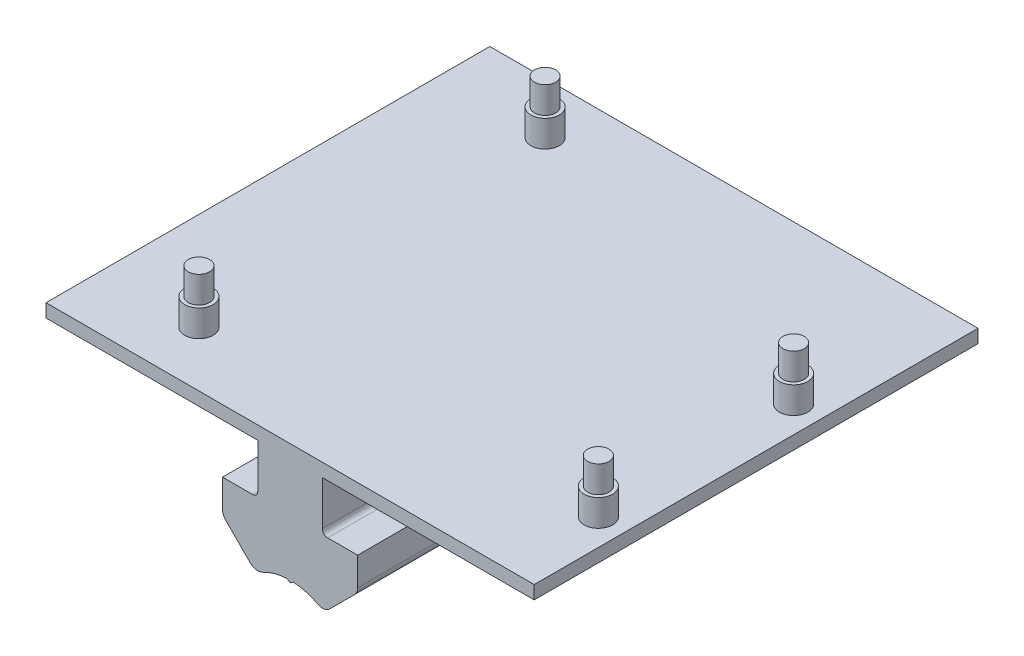
ISO-10303-21;
HEADER;
FILE_DESCRIPTION(('STEP AP214'),'2;1');
FILE_NAME('part.step','',(''),(''),'','','');
FILE_SCHEMA(('AUTOMOTIVE_DESIGN { 1 0 10303 214 1 1 1 1 }'));
ENDSEC;
DATA;
#1=APPLICATION_CONTEXT('core data for automotive mechanical design processes');
#2=APPLICATION_PROTOCOL_DEFINITION('international standard','automotive_design',2000,#1);
#3=PRODUCT_CONTEXT('',#1,'mechanical');
#4=PRODUCT('Part','Part','',(#3));
#5=PRODUCT_RELATED_PRODUCT_CATEGORY('part','',(#4));
#6=PRODUCT_DEFINITION_FORMATION('','',#4);
#7=PRODUCT_DEFINITION_CONTEXT('part definition',#1,'design');
#8=PRODUCT_DEFINITION('design','',#6,#7);
#9=PRODUCT_DEFINITION_SHAPE('','',#8);
#10=(LENGTH_UNIT() NAMED_UNIT(*) SI_UNIT(.MILLI.,.METRE.));
#11=(NAMED_UNIT(*) PLANE_ANGLE_UNIT() SI_UNIT($,.RADIAN.));
#12=(NAMED_UNIT(*) SI_UNIT($,.STERADIAN.) SOLID_ANGLE_UNIT());
#13=UNCERTAINTY_MEASURE_WITH_UNIT(LENGTH_MEASURE(1.E-05),#10,'distance_accuracy_value','');
#14=(GEOMETRIC_REPRESENTATION_CONTEXT(3) GLOBAL_UNCERTAINTY_ASSIGNED_CONTEXT((#13)) GLOBAL_UNIT_ASSIGNED_CONTEXT((#10,
#11,#12)) REPRESENTATION_CONTEXT('',''));
#15=CARTESIAN_POINT('',(0.,0.,0.));
#16=DIRECTION('',(0.,0.,1.));
#17=DIRECTION('',(1.,0.,0.));
#18=AXIS2_PLACEMENT_3D('',#15,#16,#17);
#19=CARTESIAN_POINT('',(-15.7881502716479,70.5217865494155,370.226101294247));
#20=DIRECTION('',(-1.,0.,0.));
#21=DIRECTION('',(0.,0.,1.));
#22=AXIS2_PLACEMENT_3D('',#19,#20,#21);
#23=PLANE('',#22);
#24=DIRECTION('',(0.,-1.,0.));
#25=VECTOR('',#24,1.);
#26=CARTESIAN_POINT('',(-15.7881502716479,70.5217865494155,433.726101294247));
#27=LINE('',#26,#25);
#28=CARTESIAN_POINT('',(-15.7881502716479,72.4267865494155,433.726101294247));
#29=VERTEX_POINT('',#28);
#30=CARTESIAN_POINT('',(-15.7881502716479,70.5217865494155,433.726101294247));
#31=VERTEX_POINT('',#30);
#32=EDGE_CURVE('E225',#29,#31,#27,.T.);
#33=ORIENTED_EDGE('',*,*,#32,.F.);
#34=DIRECTION('',(0.,0.,1.));
#35=VECTOR('',#34,1.);
#36=CARTESIAN_POINT('',(-15.7881502716479,72.4267865494155,370.226101294247));
#37=LINE('',#36,#35);
#38=CARTESIAN_POINT('',(-15.7881502716479,72.4267865494155,370.226101294247));
#39=VERTEX_POINT('',#38);
#40=EDGE_CURVE('E11',#39,#29,#37,.T.);
#41=ORIENTED_EDGE('',*,*,#40,.F.);
#42=DIRECTION('',(0.,-1.,0.));
#43=VECTOR('',#42,1.);
#44=CARTESIAN_POINT('',(-15.7881502716479,70.5217865494155,370.226101294247));
#45=LINE('',#44,#43);
#46=CARTESIAN_POINT('',(-15.7881502716479,70.5217865494155,370.226101294247));
#47=VERTEX_POINT('',#46);
#48=EDGE_CURVE('E291',#39,#47,#45,.T.);
#49=ORIENTED_EDGE('',*,*,#48,.T.);
#50=DIRECTION('',(0.,0.,1.));
#51=VECTOR('',#50,1.);
#52=CARTESIAN_POINT('',(-15.7881502716479,70.5217865494155,370.226101294247));
#53=LINE('',#52,#51);
#54=EDGE_CURVE('E138',#47,#31,#53,.T.);
#55=ORIENTED_EDGE('',*,*,#54,.T.);
#56=EDGE_LOOP('',(#33,#41,#49,#55));
#57=FACE_BOUND('',#56,.T.);
#58=ADVANCED_FACE('F37',(#57),#23,.T.);
#59=CARTESIAN_POINT('',(-15.7881502716479,72.4267865494155,370.226101294247));
#60=DIRECTION('',(0.,1.,0.));
#61=DIRECTION('',(0.,0.,1.));
#62=AXIS2_PLACEMENT_3D('',#59,#60,#61);
#63=PLANE('',#62);
#64=CARTESIAN_POINT('',(-1.81815027164785,72.4267865494155,425.814863045515));
#65=DIRECTION('',(0.,1.,0.));
#66=DIRECTION('',(0.,0.,1.));
#67=AXIS2_PLACEMENT_3D('',#64,#65,#66);
#68=CIRCLE('',#67,2.03200000000004);
#69=CARTESIAN_POINT('',(-1.81815027164785,72.4267865494155,427.846863045515));
#70=VERTEX_POINT('',#69);
#71=EDGE_CURVE('E628',#70,#70,#68,.T.);
#72=ORIENTED_EDGE('',*,*,#71,.F.);
#73=EDGE_LOOP('',(#72));
#74=FACE_BOUND('',#73,.T.);
#75=CARTESIAN_POINT('',(50.2518497283521,72.4267865494155,420.734863045515));
#76=DIRECTION('',(0.,1.,0.));
#77=DIRECTION('',(0.,0.,1.));
#78=AXIS2_PLACEMENT_3D('',#75,#76,#77);
#79=CIRCLE('',#78,2.03199999999995);
#80=CARTESIAN_POINT('',(50.2518497283521,72.4267865494155,422.766863045515));
#81=VERTEX_POINT('',#80);
#82=EDGE_CURVE('E347',#81,#81,#79,.T.);
#83=ORIENTED_EDGE('',*,*,#82,.F.);
#84=EDGE_LOOP('',(#83));
#85=FACE_BOUND('',#84,.T.);
#86=CARTESIAN_POINT('',(50.2518497283521,72.4267865494155,392.794863045515));
#87=DIRECTION('',(0.,1.,0.));
#88=DIRECTION('',(0.,0.,1.));
#89=AXIS2_PLACEMENT_3D('',#86,#87,#88);
#90=CIRCLE('',#89,2.03199999999995);
#91=CARTESIAN_POINT('',(50.2518497283521,72.4267865494155,394.826863045515));
#92=VERTEX_POINT('',#91);
#93=EDGE_CURVE('E343',#92,#92,#90,.T.);
#94=ORIENTED_EDGE('',*,*,#93,.F.);
#95=EDGE_LOOP('',(#94));
#96=FACE_BOUND('',#95,.T.);
#97=CARTESIAN_POINT('',(-0.548150271647851,72.4267865494155,377.554863045515));
#98=DIRECTION('',(0.,1.,0.));
#99=DIRECTION('',(0.,0.,1.));
#100=AXIS2_PLACEMENT_3D('',#97,#98,#99);
#101=CIRCLE('',#100,2.03200000000004);
#102=CARTESIAN_POINT('',(-0.548150271647851,72.4267865494155,379.586863045515));
#103=VERTEX_POINT('',#102);
#104=EDGE_CURVE('E342',#103,#103,#101,.T.);
#105=ORIENTED_EDGE('',*,*,#104,.F.);
#106=EDGE_LOOP('',(#105));
#107=FACE_BOUND('',#106,.T.);
#108=DIRECTION('',(-1.,0.,0.));
#109=VECTOR('',#108,1.);
#110=CARTESIAN_POINT('',(-15.7881502716479,72.4267865494155,433.726101294247));
#111=LINE('',#110,#109);
#112=CARTESIAN_POINT('',(54.0618497283522,72.4267865494155,433.726101294247));
#113=VERTEX_POINT('',#112);
#114=EDGE_CURVE('E289',#113,#29,#111,.T.);
#115=ORIENTED_EDGE('',*,*,#114,.F.);
#116=DIRECTION('',(0.,0.,1.));
#117=VECTOR('',#116,1.);
#118=CARTESIAN_POINT('',(54.0618497283522,72.4267865494155,370.226101294247));
#119=LINE('',#118,#117);
#120=CARTESIAN_POINT('',(54.0618497283522,72.4267865494155,370.226101294247));
#121=VERTEX_POINT('',#120);
#122=EDGE_CURVE('E46',#121,#113,#119,.T.);
#123=ORIENTED_EDGE('',*,*,#122,.F.);
#124=DIRECTION('',(-1.,0.,0.));
#125=VECTOR('',#124,1.);
#126=CARTESIAN_POINT('',(-15.7881502716479,72.4267865494155,370.226101294247));
#127=LINE('',#126,#125);
#128=EDGE_CURVE('E214',#121,#39,#127,.T.);
#129=ORIENTED_EDGE('',*,*,#128,.T.);
#130=ORIENTED_EDGE('',*,*,#40,.T.);
#131=EDGE_LOOP('',(#115,#123,#129,#130));
#132=FACE_BOUND('',#131,.T.);
#133=ADVANCED_FACE('F499',(#74,#85,#96,#107,#132),#63,.T.);
#134=CARTESIAN_POINT('',(54.0618497283522,72.4267865494155,370.226101294247));
#135=DIRECTION('',(1.,0.,0.));
#136=DIRECTION('',(0.,0.,-1.));
#137=AXIS2_PLACEMENT_3D('',#134,#135,#136);
#138=PLANE('',#137);
#139=DIRECTION('',(0.,1.,0.));
#140=VECTOR('',#139,1.);
#141=CARTESIAN_POINT('',(54.0618497283522,72.4267865494155,433.726101294247));
#142=LINE('',#141,#140);
#143=CARTESIAN_POINT('',(54.0618497283522,70.5217865494155,433.726101294247));
#144=VERTEX_POINT('',#143);
#145=EDGE_CURVE('E202',#144,#113,#142,.T.);
#146=ORIENTED_EDGE('',*,*,#145,.F.);
#147=DIRECTION('',(0.,0.,1.));
#148=VECTOR('',#147,1.);
#149=CARTESIAN_POINT('',(54.0618497283522,70.5217865494155,370.226101294247));
#150=LINE('',#149,#148);
#151=CARTESIAN_POINT('',(54.0618497283522,70.5217865494155,370.226101294247));
#152=VERTEX_POINT('',#151);
#153=EDGE_CURVE('E197',#152,#144,#150,.T.);
#154=ORIENTED_EDGE('',*,*,#153,.F.);
#155=DIRECTION('',(0.,1.,0.));
#156=VECTOR('',#155,1.);
#157=CARTESIAN_POINT('',(54.0618497283522,72.4267865494155,370.226101294247));
#158=LINE('',#157,#156);
#159=EDGE_CURVE('E200',#152,#121,#158,.T.);
#160=ORIENTED_EDGE('',*,*,#159,.T.);
#161=ORIENTED_EDGE('',*,*,#122,.T.);
#162=EDGE_LOOP('',(#146,#154,#160,#161));
#163=FACE_BOUND('',#162,.T.);
#164=ADVANCED_FACE('F199',(#163),#138,.T.);
#165=CARTESIAN_POINT('',(54.0618497283522,70.5217865494155,370.226101294247));
#166=DIRECTION('',(0.,-1.,0.));
#167=DIRECTION('',(0.,0.,-1.));
#168=AXIS2_PLACEMENT_3D('',#165,#166,#167);
#169=PLANE('',#168);
#170=DIRECTION('',(1.,0.,0.));
#171=VECTOR('',#170,1.);
#172=CARTESIAN_POINT('',(54.0618497283522,70.5217865494155,433.726101294247));
#173=LINE('',#172,#171);
#174=CARTESIAN_POINT('',(23.7558497283522,70.5217865494155,433.726101294247));
#175=VERTEX_POINT('',#174);
#176=EDGE_CURVE('E286',#175,#144,#173,.T.);
#177=ORIENTED_EDGE('',*,*,#176,.F.);
#178=DIRECTION('',(0.,0.,1.));
#179=VECTOR('',#178,1.);
#180=CARTESIAN_POINT('',(23.7558497283522,70.5217865494155,370.226101294247));
#181=LINE('',#180,#179);
#182=CARTESIAN_POINT('',(23.7558497283522,70.5217865494155,370.226101294247));
#183=VERTEX_POINT('',#182);
#184=EDGE_CURVE('E207',#183,#175,#181,.T.);
#185=ORIENTED_EDGE('',*,*,#184,.F.);
#186=DIRECTION('',(1.,0.,0.));
#187=VECTOR('',#186,1.);
#188=CARTESIAN_POINT('',(54.0618497283522,70.5217865494155,370.226101294247));
#189=LINE('',#188,#187);
#190=EDGE_CURVE('E213',#183,#152,#189,.T.);
#191=ORIENTED_EDGE('',*,*,#190,.T.);
#192=ORIENTED_EDGE('',*,*,#153,.T.);
#193=EDGE_LOOP('',(#177,#185,#191,#192));
#194=FACE_BOUND('',#193,.T.);
#195=ADVANCED_FACE('F217',(#194),#169,.T.);
#196=CARTESIAN_POINT('',(23.7558497283522,70.5217865494155,370.226101294247));
#197=DIRECTION('',(1.,0.,0.));
#198=DIRECTION('',(0.,0.,-1.));
#199=AXIS2_PLACEMENT_3D('',#196,#197,#198);
#200=PLANE('',#199);
#201=DIRECTION('',(0.,1.,0.));
#202=VECTOR('',#201,1.);
#203=CARTESIAN_POINT('',(23.7558497283522,70.5217865494155,433.726101294247));
#204=LINE('',#203,#202);
#205=CARTESIAN_POINT('',(23.7558497283522,64.1972865494153,433.726101294247));
#206=VERTEX_POINT('',#205);
#207=EDGE_CURVE('E283',#206,#175,#204,.T.);
#208=ORIENTED_EDGE('',*,*,#207,.F.);
#209=DIRECTION('',(0.,0.,1.));
#210=VECTOR('',#209,1.);
#211=CARTESIAN_POINT('',(23.7558497283522,64.1972865494153,370.226101294247));
#212=LINE('',#211,#210);
#213=CARTESIAN_POINT('',(23.7558497283522,64.1972865494153,370.226101294247));
#214=VERTEX_POINT('',#213);
#215=EDGE_CURVE('E295',#214,#206,#212,.T.);
#216=ORIENTED_EDGE('',*,*,#215,.F.);
#217=DIRECTION('',(0.,1.,0.));
#218=VECTOR('',#217,1.);
#219=CARTESIAN_POINT('',(23.7558497283522,67.9817865494152,370.226101294247));
#220=LINE('',#219,#218);
#221=EDGE_CURVE('E218',#214,#183,#220,.T.);
#222=ORIENTED_EDGE('',*,*,#221,.T.);
#223=ORIENTED_EDGE('',*,*,#184,.T.);
#224=EDGE_LOOP('',(#208,#216,#222,#223));
#225=FACE_BOUND('',#224,.T.);
#226=ADVANCED_FACE('F515',(#225),#200,.T.);
#227=CARTESIAN_POINT('',(24.5138497283521,64.1972865494153,370.226101294247));
#228=DIRECTION('',(0.,0.,1.));
#229=DIRECTION('',(1.,0.,0.));
#230=AXIS2_PLACEMENT_3D('',#227,#228,#229);
#231=CYLINDRICAL_SURFACE('',#230,0.757999999999995);
#232=CARTESIAN_POINT('',(24.5138497283521,64.1972865494153,433.726101294247));
#233=DIRECTION('',(0.,0.,-1.));
#234=DIRECTION('',(1.,0.,0.));
#235=AXIS2_PLACEMENT_3D('',#232,#233,#234);
#236=CIRCLE('',#235,0.757999999999995);
#237=CARTESIAN_POINT('',(24.5138497283522,63.4392865494153,433.726101294247));
#238=VERTEX_POINT('',#237);
#239=EDGE_CURVE('E280',#238,#206,#236,.T.);
#240=ORIENTED_EDGE('',*,*,#239,.F.);
#241=DIRECTION('',(0.,0.,1.));
#242=VECTOR('',#241,1.);
#243=CARTESIAN_POINT('',(24.5138497283522,63.4392865494153,370.226101294247));
#244=LINE('',#243,#242);
#245=CARTESIAN_POINT('',(24.5138497283522,63.4392865494153,370.226101294247));
#246=VERTEX_POINT('',#245);
#247=EDGE_CURVE('E298',#246,#238,#244,.T.);
#248=ORIENTED_EDGE('',*,*,#247,.F.);
#249=CARTESIAN_POINT('',(24.5138497283521,64.1972865494153,370.226101294247));
#250=DIRECTION('',(0.,0.,-1.));
#251=DIRECTION('',(1.,0.,0.));
#252=AXIS2_PLACEMENT_3D('',#249,#250,#251);
#253=CIRCLE('',#252,0.757999999999995);
#254=EDGE_CURVE('E220',#246,#214,#253,.T.);
#255=ORIENTED_EDGE('',*,*,#254,.T.);
#256=ORIENTED_EDGE('',*,*,#215,.T.);
#257=EDGE_LOOP('',(#240,#248,#255,#256));
#258=FACE_BOUND('',#257,.T.);
#259=ADVANCED_FACE('F431',(#258),#231,.F.);
#260=CARTESIAN_POINT('',(24.5138497283522,63.4392865494153,370.226101294247));
#261=DIRECTION('',(0.,1.,0.));
#262=DIRECTION('',(0.,0.,1.));
#263=AXIS2_PLACEMENT_3D('',#260,#261,#262);
#264=PLANE('',#263);
#265=DIRECTION('',(-1.,0.,0.));
#266=VECTOR('',#265,1.);
#267=CARTESIAN_POINT('',(24.5138497283522,63.4392865494153,433.726101294247));
#268=LINE('',#267,#266);
#269=CARTESIAN_POINT('',(28.8058497283522,63.4392865494153,433.726101294247));
#270=VERTEX_POINT('',#269);
#271=EDGE_CURVE('E277',#270,#238,#268,.T.);
#272=ORIENTED_EDGE('',*,*,#271,.F.);
#273=DIRECTION('',(0.,0.,1.));
#274=VECTOR('',#273,1.);
#275=CARTESIAN_POINT('',(28.8058497283522,63.4392865494153,370.226101294247));
#276=LINE('',#275,#274);
#277=CARTESIAN_POINT('',(28.8058497283522,63.4392865494153,370.226101294247));
#278=VERTEX_POINT('',#277);
#279=EDGE_CURVE('E300',#278,#270,#276,.T.);
#280=ORIENTED_EDGE('',*,*,#279,.F.);
#281=DIRECTION('',(-1.,0.,0.));
#282=VECTOR('',#281,1.);
#283=CARTESIAN_POINT('',(24.5138497283522,63.4392865494153,370.226101294247));
#284=LINE('',#283,#282);
#285=EDGE_CURVE('E425',#278,#246,#284,.T.);
#286=ORIENTED_EDGE('',*,*,#285,.T.);
#287=ORIENTED_EDGE('',*,*,#247,.T.);
#288=EDGE_LOOP('',(#272,#280,#286,#287));
#289=FACE_BOUND('',#288,.T.);
#290=ADVANCED_FACE('F436',(#289),#264,.T.);
#291=CARTESIAN_POINT('',(28.8058497283522,63.4392865494153,370.226101294247));
#292=DIRECTION('',(1.,0.,0.));
#293=DIRECTION('',(0.,0.,-1.));
#294=AXIS2_PLACEMENT_3D('',#291,#292,#293);
#295=PLANE('',#294);
#296=DIRECTION('',(0.,1.,0.));
#297=VECTOR('',#296,1.);
#298=CARTESIAN_POINT('',(28.8058497283522,63.4392865494153,433.726101294247));
#299=LINE('',#298,#297);
#300=CARTESIAN_POINT('',(28.8058497283522,59.4010791144885,433.726101294247));
#301=VERTEX_POINT('',#300);
#302=EDGE_CURVE('E274',#301,#270,#299,.T.);
#303=ORIENTED_EDGE('',*,*,#302,.F.);
#304=DIRECTION('',(0.,0.,1.));
#305=VECTOR('',#304,1.);
#306=CARTESIAN_POINT('',(28.8058497283522,59.4010791144885,370.226101294247));
#307=LINE('',#306,#305);
#308=CARTESIAN_POINT('',(28.8058497283522,59.4010791144885,370.226101294247));
#309=VERTEX_POINT('',#308);
#310=EDGE_CURVE('E302',#309,#301,#307,.T.);
#311=ORIENTED_EDGE('',*,*,#310,.F.);
#312=DIRECTION('',(0.,1.,0.));
#313=VECTOR('',#312,1.);
#314=CARTESIAN_POINT('',(28.8058497283522,63.4392865494153,370.226101294247));
#315=LINE('',#314,#313);
#316=EDGE_CURVE('E422',#309,#278,#315,.T.);
#317=ORIENTED_EDGE('',*,*,#316,.T.);
#318=ORIENTED_EDGE('',*,*,#279,.T.);
#319=EDGE_LOOP('',(#303,#311,#317,#318));
#320=FACE_BOUND('',#319,.T.);
#321=ADVANCED_FACE('F439',(#320),#295,.T.);
#322=CARTESIAN_POINT('',(27.3018497283522,59.4010791144885,370.226101294247));
#323=DIRECTION('',(0.,0.,1.));
#324=DIRECTION('',(1.,0.,0.));
#325=AXIS2_PLACEMENT_3D('',#322,#323,#324);
#326=CYLINDRICAL_SURFACE('',#325,1.504);
#327=CARTESIAN_POINT('',(27.3018497283522,59.4010791144885,433.726101294247));
#328=DIRECTION('',(0.,0.,1.));
#329=DIRECTION('',(1.,0.,0.));
#330=AXIS2_PLACEMENT_3D('',#327,#328,#329);
#331=CIRCLE('',#330,1.504);
#332=CARTESIAN_POINT('',(28.3653383272567,58.337590515584,433.726101294247));
#333=VERTEX_POINT('',#332);
#334=EDGE_CURVE('E271',#333,#301,#331,.T.);
#335=ORIENTED_EDGE('',*,*,#334,.F.);
#336=DIRECTION('',(0.,0.,1.));
#337=VECTOR('',#336,1.);
#338=CARTESIAN_POINT('',(28.3653383272567,58.337590515584,370.226101294247));
#339=LINE('',#338,#337);
#340=CARTESIAN_POINT('',(28.3653383272567,58.337590515584,370.226101294247));
#341=VERTEX_POINT('',#340);
#342=EDGE_CURVE('E304',#341,#333,#339,.T.);
#343=ORIENTED_EDGE('',*,*,#342,.F.);
#344=CARTESIAN_POINT('',(27.3018497283522,59.4010791144885,370.226101294247));
#345=DIRECTION('',(0.,0.,1.));
#346=DIRECTION('',(1.,0.,0.));
#347=AXIS2_PLACEMENT_3D('',#344,#345,#346);
#348=CIRCLE('',#347,1.504);
#349=EDGE_CURVE('E419',#341,#309,#348,.T.);
#350=ORIENTED_EDGE('',*,*,#349,.T.);
#351=ORIENTED_EDGE('',*,*,#310,.T.);
#352=EDGE_LOOP('',(#335,#343,#350,#351));
#353=FACE_BOUND('',#352,.T.);
#354=ADVANCED_FACE('F444',(#353),#326,.T.);
#355=CARTESIAN_POINT('',(28.3653383272567,58.337590515584,370.226101294247));
#356=DIRECTION('',(0.707106781186548,-0.707106781186548,0.));
#357=DIRECTION('',(0.707106781186548,0.707106781186548,0.));
#358=AXIS2_PLACEMENT_3D('',#355,#356,#357);
#359=PLANE('',#358);
#360=DIRECTION('',(0.707106781186547,0.707106781186547,0.));
#361=VECTOR('',#360,1.);
#362=CARTESIAN_POINT('',(28.3653383272567,58.337590515584,433.726101294247));
#363=LINE('',#362,#361);
#364=CARTESIAN_POINT('',(24.8223878072485,54.7946399955758,433.726101294247));
#365=VERTEX_POINT('',#364);
#366=EDGE_CURVE('E268',#365,#333,#363,.T.);
#367=ORIENTED_EDGE('',*,*,#366,.F.);
#368=DIRECTION('',(0.,0.,1.));
#369=VECTOR('',#368,1.);
#370=CARTESIAN_POINT('',(24.8223878072485,54.7946399955758,370.226101294247));
#371=LINE('',#370,#369);
#372=CARTESIAN_POINT('',(24.8223878072485,54.7946399955758,370.226101294247));
#373=VERTEX_POINT('',#372);
#374=EDGE_CURVE('E306',#373,#365,#371,.T.);
#375=ORIENTED_EDGE('',*,*,#374,.F.);
#376=DIRECTION('',(0.707106781186547,0.707106781186547,0.));
#377=VECTOR('',#376,1.);
#378=CARTESIAN_POINT('',(28.3653383272567,58.337590515584,370.226101294247));
#379=LINE('',#378,#377);
#380=EDGE_CURVE('E416',#373,#341,#379,.T.);
#381=ORIENTED_EDGE('',*,*,#380,.T.);
#382=ORIENTED_EDGE('',*,*,#342,.T.);
#383=EDGE_LOOP('',(#367,#375,#381,#382));
#384=FACE_BOUND('',#383,.T.);
#385=ADVANCED_FACE('F447',(#384),#359,.T.);
#386=CARTESIAN_POINT('',(23.758899208344,55.8581285944804,370.226101294247));
#387=DIRECTION('',(0.,0.,1.));
#388=DIRECTION('',(1.,0.,0.));
#389=AXIS2_PLACEMENT_3D('',#386,#387,#388);
#390=CYLINDRICAL_SURFACE('',#389,1.504);
#391=CARTESIAN_POINT('',(23.758899208344,55.8581285944804,433.726101294247));
#392=DIRECTION('',(0.,0.,1.));
#393=DIRECTION('',(1.,0.,0.));
#394=AXIS2_PLACEMENT_3D('',#391,#392,#393);
#395=CIRCLE('',#394,1.504);
#396=CARTESIAN_POINT('',(23.0556556658141,54.5286683581852,433.726101294247));
#397=VERTEX_POINT('',#396);
#398=EDGE_CURVE('E265',#397,#365,#395,.T.);
#399=ORIENTED_EDGE('',*,*,#398,.F.);
#400=DIRECTION('',(0.,0.,1.));
#401=VECTOR('',#400,1.);
#402=CARTESIAN_POINT('',(23.0556556658141,54.5286683581852,370.226101294247));
#403=LINE('',#402,#401);
#404=CARTESIAN_POINT('',(23.0556556658141,54.5286683581852,370.226101294247));
#405=VERTEX_POINT('',#404);
#406=EDGE_CURVE('E308',#405,#397,#403,.T.);
#407=ORIENTED_EDGE('',*,*,#406,.F.);
#408=CARTESIAN_POINT('',(23.758899208344,55.8581285944804,370.226101294247));
#409=DIRECTION('',(0.,0.,1.));
#410=DIRECTION('',(1.,0.,0.));
#411=AXIS2_PLACEMENT_3D('',#408,#409,#410);
#412=CIRCLE('',#411,1.504);
#413=EDGE_CURVE('E413',#405,#373,#412,.T.);
#414=ORIENTED_EDGE('',*,*,#413,.T.);
#415=ORIENTED_EDGE('',*,*,#374,.T.);
#416=EDGE_LOOP('',(#399,#407,#414,#415));
#417=FACE_BOUND('',#416,.T.);
#418=ADVANCED_FACE('F452',(#417),#390,.T.);
#419=CARTESIAN_POINT('',(19.1368497283521,47.1202865494153,370.226101294247));
#420=DIRECTION('',(0.,0.,1.));
#421=DIRECTION('',(1.,0.,0.));
#422=AXIS2_PLACEMENT_3D('',#419,#420,#421);
#423=CYLINDRICAL_SURFACE('',#422,8.38099999999999);
#424=CARTESIAN_POINT('',(19.1368497283521,47.1202865494153,433.726101294247));
#425=DIRECTION('',(0.,0.,-1.));
#426=DIRECTION('',(1.,0.,0.));
#427=AXIS2_PLACEMENT_3D('',#424,#425,#426);
#428=CIRCLE('',#427,8.38099999999999);
#429=CARTESIAN_POINT('',(19.5801508375711,55.4895544461052,433.726101294247));
#430=VERTEX_POINT('',#429);
#431=EDGE_CURVE('E262',#430,#397,#428,.T.);
#432=ORIENTED_EDGE('',*,*,#431,.F.);
#433=DIRECTION('',(0.,0.,1.));
#434=VECTOR('',#433,1.);
#435=CARTESIAN_POINT('',(19.5801508375711,55.4895544461052,370.226101294247));
#436=LINE('',#435,#434);
#437=CARTESIAN_POINT('',(19.5801508375711,55.4895544461052,370.226101294247));
#438=VERTEX_POINT('',#437);
#439=EDGE_CURVE('E310',#438,#430,#436,.T.);
#440=ORIENTED_EDGE('',*,*,#439,.F.);
#441=CARTESIAN_POINT('',(19.1368497283521,47.1202865494153,370.226101294247));
#442=DIRECTION('',(0.,0.,-1.));
#443=DIRECTION('',(1.,0.,0.));
#444=AXIS2_PLACEMENT_3D('',#441,#442,#443);
#445=CIRCLE('',#444,8.38099999999999);
#446=EDGE_CURVE('E410',#438,#405,#445,.T.);
#447=ORIENTED_EDGE('',*,*,#446,.T.);
#448=ORIENTED_EDGE('',*,*,#406,.T.);
#449=EDGE_LOOP('',(#432,#440,#447,#448));
#450=FACE_BOUND('',#449,.T.);
#451=ADVANCED_FACE('F455',(#450),#423,.F.);
#452=CARTESIAN_POINT('',(19.5801508375711,55.4895544461052,370.226101294247));
#453=DIRECTION('',(0.573576436351056,-0.819152044288985,0.));
#454=DIRECTION('',(0.819152044288985,0.573576436351056,0.));
#455=AXIS2_PLACEMENT_3D('',#452,#453,#454);
#456=PLANE('',#455);
#457=DIRECTION('',(0.819152044288985,0.573576436351056,0.));
#458=VECTOR('',#457,1.);
#459=CARTESIAN_POINT('',(19.5801508375711,55.4895544461052,433.726101294247));
#460=LINE('',#459,#458);
#461=CARTESIAN_POINT('',(19.1368497283522,55.1791516677334,433.726101294247));
#462=VERTEX_POINT('',#461);
#463=EDGE_CURVE('E259',#462,#430,#460,.T.);
#464=ORIENTED_EDGE('',*,*,#463,.F.);
#465=DIRECTION('',(0.,0.,1.));
#466=VECTOR('',#465,1.);
#467=CARTESIAN_POINT('',(19.1368497283522,55.1791516677334,370.226101294247));
#468=LINE('',#467,#466);
#469=CARTESIAN_POINT('',(19.1368497283522,55.1791516677334,370.226101294247));
#470=VERTEX_POINT('',#469);
#471=EDGE_CURVE('E312',#470,#462,#468,.T.);
#472=ORIENTED_EDGE('',*,*,#471,.F.);
#473=DIRECTION('',(0.819152044288985,0.573576436351056,0.));
#474=VECTOR('',#473,1.);
#475=CARTESIAN_POINT('',(19.5801508375711,55.4895544461052,370.226101294247));
#476=LINE('',#475,#474);
#477=EDGE_CURVE('E407',#470,#438,#476,.T.);
#478=ORIENTED_EDGE('',*,*,#477,.T.);
#479=ORIENTED_EDGE('',*,*,#439,.T.);
#480=EDGE_LOOP('',(#464,#472,#478,#479));
#481=FACE_BOUND('',#480,.T.);
#482=ADVANCED_FACE('F460',(#481),#456,.T.);
#483=CARTESIAN_POINT('',(19.1368497283522,55.1791516677334,370.226101294247));
#484=DIRECTION('',(-0.57357643635105,-0.819152044288989,0.));
#485=DIRECTION('',(0.819152044288989,-0.57357643635105,0.));
#486=AXIS2_PLACEMENT_3D('',#483,#484,#485);
#487=PLANE('',#486);
#488=DIRECTION('',(0.819152044288989,-0.57357643635105,0.));
#489=VECTOR('',#488,1.);
#490=CARTESIAN_POINT('',(19.1368497283522,55.1791516677334,433.726101294247));
#491=LINE('',#490,#489);
#492=CARTESIAN_POINT('',(18.6935486191332,55.4895544461052,433.726101294247));
#493=VERTEX_POINT('',#492);
#494=EDGE_CURVE('E256',#493,#462,#491,.T.);
#495=ORIENTED_EDGE('',*,*,#494,.F.);
#496=DIRECTION('',(0.,0.,1.));
#497=VECTOR('',#496,1.);
#498=CARTESIAN_POINT('',(18.6935486191332,55.4895544461052,370.226101294247));
#499=LINE('',#498,#497);
#500=CARTESIAN_POINT('',(18.6935486191332,55.4895544461052,370.226101294247));
#501=VERTEX_POINT('',#500);
#502=EDGE_CURVE('E314',#501,#493,#499,.T.);
#503=ORIENTED_EDGE('',*,*,#502,.F.);
#504=DIRECTION('',(0.819152044288989,-0.57357643635105,0.));
#505=VECTOR('',#504,1.);
#506=CARTESIAN_POINT('',(19.1368497283522,55.1791516677334,370.226101294247));
#507=LINE('',#506,#505);
#508=EDGE_CURVE('E404',#501,#470,#507,.T.);
#509=ORIENTED_EDGE('',*,*,#508,.T.);
#510=ORIENTED_EDGE('',*,*,#471,.T.);
#511=EDGE_LOOP('',(#495,#503,#509,#510));
#512=FACE_BOUND('',#511,.T.);
#513=ADVANCED_FACE('F463',(#512),#487,.T.);
#514=CARTESIAN_POINT('',(19.1368497283521,47.1202865494153,370.226101294247));
#515=DIRECTION('',(0.,0.,1.));
#516=DIRECTION('',(1.,0.,0.));
#517=AXIS2_PLACEMENT_3D('',#514,#515,#516);
#518=CYLINDRICAL_SURFACE('',#517,8.381);
#519=CARTESIAN_POINT('',(19.1368497283521,47.1202865494153,433.726101294247));
#520=DIRECTION('',(0.,0.,-1.));
#521=DIRECTION('',(1.,0.,0.));
#522=AXIS2_PLACEMENT_3D('',#519,#520,#521);
#523=CIRCLE('',#522,8.381);
#524=CARTESIAN_POINT('',(15.2180437908902,54.5286683581852,433.726101294247));
#525=VERTEX_POINT('',#524);
#526=EDGE_CURVE('E253',#525,#493,#523,.T.);
#527=ORIENTED_EDGE('',*,*,#526,.F.);
#528=DIRECTION('',(0.,0.,1.));
#529=VECTOR('',#528,1.);
#530=CARTESIAN_POINT('',(15.2180437908902,54.5286683581852,370.226101294247));
#531=LINE('',#530,#529);
#532=CARTESIAN_POINT('',(15.2180437908902,54.5286683581852,370.226101294247));
#533=VERTEX_POINT('',#532);
#534=EDGE_CURVE('E316',#533,#525,#531,.T.);
#535=ORIENTED_EDGE('',*,*,#534,.F.);
#536=CARTESIAN_POINT('',(19.1368497283521,47.1202865494153,370.226101294247));
#537=DIRECTION('',(0.,0.,-1.));
#538=DIRECTION('',(1.,0.,0.));
#539=AXIS2_PLACEMENT_3D('',#536,#537,#538);
#540=CIRCLE('',#539,8.381);
#541=EDGE_CURVE('E401',#533,#501,#540,.T.);
#542=ORIENTED_EDGE('',*,*,#541,.T.);
#543=ORIENTED_EDGE('',*,*,#502,.T.);
#544=EDGE_LOOP('',(#527,#535,#542,#543));
#545=FACE_BOUND('',#544,.T.);
#546=ADVANCED_FACE('F468',(#545),#518,.F.);
#547=CARTESIAN_POINT('',(14.5148002483603,55.8581285944804,370.226101294247));
#548=DIRECTION('',(0.,0.,1.));
#549=DIRECTION('',(1.,0.,0.));
#550=AXIS2_PLACEMENT_3D('',#547,#548,#549);
#551=CYLINDRICAL_SURFACE('',#550,1.504);
#552=CARTESIAN_POINT('',(14.5148002483603,55.8581285944804,433.726101294247));
#553=DIRECTION('',(0.,0.,1.));
#554=DIRECTION('',(1.,0.,0.));
#555=AXIS2_PLACEMENT_3D('',#552,#553,#554);
#556=CIRCLE('',#555,1.504);
#557=CARTESIAN_POINT('',(13.4513116494558,54.7946399955758,433.726101294247));
#558=VERTEX_POINT('',#557);
#559=EDGE_CURVE('E250',#558,#525,#556,.T.);
#560=ORIENTED_EDGE('',*,*,#559,.F.);
#561=DIRECTION('',(0.,0.,1.));
#562=VECTOR('',#561,1.);
#563=CARTESIAN_POINT('',(13.4513116494558,54.7946399955758,370.226101294247));
#564=LINE('',#563,#562);
#565=CARTESIAN_POINT('',(13.4513116494558,54.7946399955758,370.226101294247));
#566=VERTEX_POINT('',#565);
#567=EDGE_CURVE('E318',#566,#558,#564,.T.);
#568=ORIENTED_EDGE('',*,*,#567,.F.);
#569=CARTESIAN_POINT('',(14.5148002483603,55.8581285944804,370.226101294247));
#570=DIRECTION('',(0.,0.,1.));
#571=DIRECTION('',(1.,0.,0.));
#572=AXIS2_PLACEMENT_3D('',#569,#570,#571);
#573=CIRCLE('',#572,1.504);
#574=EDGE_CURVE('E398',#566,#533,#573,.T.);
#575=ORIENTED_EDGE('',*,*,#574,.T.);
#576=ORIENTED_EDGE('',*,*,#534,.T.);
#577=EDGE_LOOP('',(#560,#568,#575,#576));
#578=FACE_BOUND('',#577,.T.);
#579=ADVANCED_FACE('F471',(#578),#551,.T.);
#580=CARTESIAN_POINT('',(13.4513116494558,54.7946399955758,370.226101294247));
#581=DIRECTION('',(-0.707106781186548,-0.707106781186547,0.));
#582=DIRECTION('',(0.707106781186547,-0.707106781186548,0.));
#583=AXIS2_PLACEMENT_3D('',#580,#581,#582);
#584=PLANE('',#583);
#585=DIRECTION('',(0.707106781186547,-0.707106781186548,0.));
#586=VECTOR('',#585,1.);
#587=CARTESIAN_POINT('',(13.4513116494558,54.7946399955758,433.726101294247));
#588=LINE('',#587,#586);
#589=CARTESIAN_POINT('',(9.90836112944758,58.337590515584,433.726101294247));
#590=VERTEX_POINT('',#589);
#591=EDGE_CURVE('E247',#590,#558,#588,.T.);
#592=ORIENTED_EDGE('',*,*,#591,.F.);
#593=DIRECTION('',(0.,0.,1.));
#594=VECTOR('',#593,1.);
#595=CARTESIAN_POINT('',(9.90836112944758,58.337590515584,370.226101294247));
#596=LINE('',#595,#594);
#597=CARTESIAN_POINT('',(9.90836112944758,58.337590515584,370.226101294247));
#598=VERTEX_POINT('',#597);
#599=EDGE_CURVE('E320',#598,#590,#596,.T.);
#600=ORIENTED_EDGE('',*,*,#599,.F.);
#601=DIRECTION('',(0.707106781186547,-0.707106781186548,0.));
#602=VECTOR('',#601,1.);
#603=CARTESIAN_POINT('',(13.4513116494558,54.7946399955758,370.226101294247));
#604=LINE('',#603,#602);
#605=EDGE_CURVE('E395',#598,#566,#604,.T.);
#606=ORIENTED_EDGE('',*,*,#605,.T.);
#607=ORIENTED_EDGE('',*,*,#567,.T.);
#608=EDGE_LOOP('',(#592,#600,#606,#607));
#609=FACE_BOUND('',#608,.T.);
#610=ADVANCED_FACE('F476',(#609),#584,.T.);
#611=CARTESIAN_POINT('',(10.9718497283522,59.4010791144885,370.226101294247));
#612=DIRECTION('',(0.,0.,1.));
#613=DIRECTION('',(1.,0.,0.));
#614=AXIS2_PLACEMENT_3D('',#611,#612,#613);
#615=CYLINDRICAL_SURFACE('',#614,1.504);
#616=CARTESIAN_POINT('',(10.9718497283522,59.4010791144885,433.726101294247));
#617=DIRECTION('',(0.,0.,1.));
#618=DIRECTION('',(1.,0.,0.));
#619=AXIS2_PLACEMENT_3D('',#616,#617,#618);
#620=CIRCLE('',#619,1.504);
#621=CARTESIAN_POINT('',(9.46784972835215,59.4010791144885,433.726101294247));
#622=VERTEX_POINT('',#621);
#623=EDGE_CURVE('E244',#622,#590,#620,.T.);
#624=ORIENTED_EDGE('',*,*,#623,.F.);
#625=DIRECTION('',(0.,0.,1.));
#626=VECTOR('',#625,1.);
#627=CARTESIAN_POINT('',(9.46784972835215,59.4010791144885,370.226101294247));
#628=LINE('',#627,#626);
#629=CARTESIAN_POINT('',(9.46784972835215,59.4010791144885,370.226101294247));
#630=VERTEX_POINT('',#629);
#631=EDGE_CURVE('E322',#630,#622,#628,.T.);
#632=ORIENTED_EDGE('',*,*,#631,.F.);
#633=CARTESIAN_POINT('',(10.9718497283522,59.4010791144885,370.226101294247));
#634=DIRECTION('',(0.,0.,1.));
#635=DIRECTION('',(1.,0.,0.));
#636=AXIS2_PLACEMENT_3D('',#633,#634,#635);
#637=CIRCLE('',#636,1.504);
#638=EDGE_CURVE('E392',#630,#598,#637,.T.);
#639=ORIENTED_EDGE('',*,*,#638,.T.);
#640=ORIENTED_EDGE('',*,*,#599,.T.);
#641=EDGE_LOOP('',(#624,#632,#639,#640));
#642=FACE_BOUND('',#641,.T.);
#643=ADVANCED_FACE('F479',(#642),#615,.T.);
#644=CARTESIAN_POINT('',(9.46784972835215,59.4010791144885,370.226101294247));
#645=DIRECTION('',(-1.,0.,0.));
#646=DIRECTION('',(0.,0.,1.));
#647=AXIS2_PLACEMENT_3D('',#644,#645,#646);
#648=PLANE('',#647);
#649=DIRECTION('',(0.,-1.,0.));
#650=VECTOR('',#649,1.);
#651=CARTESIAN_POINT('',(9.46784972835215,59.4010791144885,433.726101294247));
#652=LINE('',#651,#650);
#653=CARTESIAN_POINT('',(9.46784972835215,63.4392865494153,433.726101294247));
#654=VERTEX_POINT('',#653);
#655=EDGE_CURVE('E241',#654,#622,#652,.T.);
#656=ORIENTED_EDGE('',*,*,#655,.F.);
#657=DIRECTION('',(0.,0.,1.));
#658=VECTOR('',#657,1.);
#659=CARTESIAN_POINT('',(9.46784972835215,63.4392865494153,370.226101294247));
#660=LINE('',#659,#658);
#661=CARTESIAN_POINT('',(9.46784972835215,63.4392865494153,370.226101294247));
#662=VERTEX_POINT('',#661);
#663=EDGE_CURVE('E324',#662,#654,#660,.T.);
#664=ORIENTED_EDGE('',*,*,#663,.F.);
#665=DIRECTION('',(0.,-1.,0.));
#666=VECTOR('',#665,1.);
#667=CARTESIAN_POINT('',(9.46784972835215,59.4010791144885,370.226101294247));
#668=LINE('',#667,#666);
#669=EDGE_CURVE('E389',#662,#630,#668,.T.);
#670=ORIENTED_EDGE('',*,*,#669,.T.);
#671=ORIENTED_EDGE('',*,*,#631,.T.);
#672=EDGE_LOOP('',(#656,#664,#670,#671));
#673=FACE_BOUND('',#672,.T.);
#674=ADVANCED_FACE('F485',(#673),#648,.T.);
#675=CARTESIAN_POINT('',(9.46784972835215,63.4392865494153,370.226101294247));
#676=DIRECTION('',(0.,1.,0.));
#677=DIRECTION('',(-1.,0.,0.));
#678=AXIS2_PLACEMENT_3D('',#675,#676,#677);
#679=PLANE('',#678);
#680=DIRECTION('',(-1.,0.,0.));
#681=VECTOR('',#680,1.);
#682=CARTESIAN_POINT('',(9.46784972835215,63.4392865494153,433.726101294247));
#683=LINE('',#682,#681);
#684=CARTESIAN_POINT('',(13.7598497283522,63.4392865494153,433.726101294247));
#685=VERTEX_POINT('',#684);
#686=EDGE_CURVE('E238',#685,#654,#683,.T.);
#687=ORIENTED_EDGE('',*,*,#686,.F.);
#688=DIRECTION('',(0.,0.,1.));
#689=VECTOR('',#688,1.);
#690=CARTESIAN_POINT('',(13.7598497283522,63.4392865494153,370.226101294247));
#691=LINE('',#690,#689);
#692=CARTESIAN_POINT('',(13.7598497283522,63.4392865494153,370.226101294247));
#693=VERTEX_POINT('',#692);
#694=EDGE_CURVE('E326',#693,#685,#691,.T.);
#695=ORIENTED_EDGE('',*,*,#694,.F.);
#696=DIRECTION('',(-1.,0.,0.));
#697=VECTOR('',#696,1.);
#698=CARTESIAN_POINT('',(12.817159361088,63.4392865494153,370.226101294247));
#699=LINE('',#698,#697);
#700=EDGE_CURVE('E387',#693,#662,#699,.T.);
#701=ORIENTED_EDGE('',*,*,#700,.T.);
#702=ORIENTED_EDGE('',*,*,#663,.T.);
#703=EDGE_LOOP('',(#687,#695,#701,#702));
#704=FACE_BOUND('',#703,.T.);
#705=ADVANCED_FACE('F487',(#704),#679,.T.);
#706=CARTESIAN_POINT('',(13.7598497283522,64.1972865494153,370.226101294247));
#707=DIRECTION('',(0.,0.,1.));
#708=DIRECTION('',(1.,0.,0.));
#709=AXIS2_PLACEMENT_3D('',#706,#707,#708);
#710=CYLINDRICAL_SURFACE('',#709,0.757999999999997);
#711=CARTESIAN_POINT('',(13.7598497283522,64.1972865494153,433.726101294247));
#712=DIRECTION('',(0.,0.,-1.));
#713=DIRECTION('',(1.,0.,0.));
#714=AXIS2_PLACEMENT_3D('',#711,#712,#713);
#715=CIRCLE('',#714,0.757999999999997);
#716=CARTESIAN_POINT('',(14.5178497283521,64.1972865494153,433.726101294247));
#717=VERTEX_POINT('',#716);
#718=EDGE_CURVE('E235',#717,#685,#715,.T.);
#719=ORIENTED_EDGE('',*,*,#718,.F.);
#720=DIRECTION('',(0.,0.,1.));
#721=VECTOR('',#720,1.);
#722=CARTESIAN_POINT('',(14.5178497283521,64.1972865494153,370.226101294247));
#723=LINE('',#722,#721);
#724=CARTESIAN_POINT('',(14.5178497283521,64.1972865494153,370.226101294247));
#725=VERTEX_POINT('',#724);
#726=EDGE_CURVE('E329',#725,#717,#723,.T.);
#727=ORIENTED_EDGE('',*,*,#726,.F.);
#728=CARTESIAN_POINT('',(13.7598497283522,64.1972865494153,370.226101294247));
#729=DIRECTION('',(0.,0.,-1.));
#730=DIRECTION('',(1.,0.,0.));
#731=AXIS2_PLACEMENT_3D('',#728,#729,#730);
#732=CIRCLE('',#731,0.757999999999997);
#733=EDGE_CURVE('E384',#725,#693,#732,.T.);
#734=ORIENTED_EDGE('',*,*,#733,.T.);
#735=ORIENTED_EDGE('',*,*,#694,.T.);
#736=EDGE_LOOP('',(#719,#727,#734,#735));
#737=FACE_BOUND('',#736,.T.);
#738=ADVANCED_FACE('F493',(#737),#710,.F.);
#739=CARTESIAN_POINT('',(14.5178497283521,64.1972865494153,370.226101294247));
#740=DIRECTION('',(-1.,0.,0.));
#741=DIRECTION('',(0.,0.,1.));
#742=AXIS2_PLACEMENT_3D('',#739,#740,#741);
#743=PLANE('',#742);
#744=DIRECTION('',(0.,-1.,0.));
#745=VECTOR('',#744,1.);
#746=CARTESIAN_POINT('',(14.5178497283521,64.1972865494153,433.726101294247));
#747=LINE('',#746,#745);
#748=CARTESIAN_POINT('',(14.5178497283521,70.5217865494155,433.726101294247));
#749=VERTEX_POINT('',#748);
#750=EDGE_CURVE('E232',#749,#717,#747,.T.);
#751=ORIENTED_EDGE('',*,*,#750,.F.);
#752=DIRECTION('',(0.,0.,1.));
#753=VECTOR('',#752,1.);
#754=CARTESIAN_POINT('',(14.5178497283521,70.5217865494155,370.226101294247));
#755=LINE('',#754,#753);
#756=CARTESIAN_POINT('',(14.5178497283521,70.5217865494155,370.226101294247));
#757=VERTEX_POINT('',#756);
#758=EDGE_CURVE('E331',#757,#749,#755,.T.);
#759=ORIENTED_EDGE('',*,*,#758,.F.);
#760=DIRECTION('',(0.,-1.,0.));
#761=VECTOR('',#760,1.);
#762=CARTESIAN_POINT('',(14.5178497283521,67.9817865494152,370.226101294247));
#763=LINE('',#762,#761);
#764=EDGE_CURVE('E382',#757,#725,#763,.T.);
#765=ORIENTED_EDGE('',*,*,#764,.T.);
#766=ORIENTED_EDGE('',*,*,#726,.T.);
#767=EDGE_LOOP('',(#751,#759,#765,#766));
#768=FACE_BOUND('',#767,.T.);
#769=ADVANCED_FACE('F495',(#768),#743,.T.);
#770=CARTESIAN_POINT('',(14.5178497283521,70.5217865494155,370.226101294247));
#771=DIRECTION('',(0.,-1.,0.));
#772=DIRECTION('',(0.,0.,-1.));
#773=AXIS2_PLACEMENT_3D('',#770,#771,#772);
#774=PLANE('',#773);
#775=DIRECTION('',(1.,0.,0.));
#776=VECTOR('',#775,1.);
#777=CARTESIAN_POINT('',(14.5178497283521,70.5217865494155,433.726101294247));
#778=LINE('',#777,#776);
#779=EDGE_CURVE('E228',#31,#749,#778,.T.);
#780=ORIENTED_EDGE('',*,*,#779,.F.);
#781=ORIENTED_EDGE('',*,*,#54,.F.);
#782=DIRECTION('',(1.,0.,0.));
#783=VECTOR('',#782,1.);
#784=CARTESIAN_POINT('',(14.5178497283521,70.5217865494155,370.226101294247));
#785=LINE('',#784,#783);
#786=EDGE_CURVE('E380',#47,#757,#785,.T.);
#787=ORIENTED_EDGE('',*,*,#786,.T.);
#788=ORIENTED_EDGE('',*,*,#758,.T.);
#789=EDGE_LOOP('',(#780,#781,#787,#788));
#790=FACE_BOUND('',#789,.T.);
#791=ADVANCED_FACE('F496',(#790),#774,.T.);
#792=CARTESIAN_POINT('',(24.5138497283521,64.1972865494153,370.226101294247));
#793=DIRECTION('',(0.,0.,1.));
#794=DIRECTION('',(1.,0.,0.));
#795=AXIS2_PLACEMENT_3D('',#792,#793,#794);
#796=PLANE('',#795);
#797=ORIENTED_EDGE('',*,*,#48,.F.);
#798=ORIENTED_EDGE('',*,*,#128,.F.);
#799=ORIENTED_EDGE('',*,*,#159,.F.);
#800=ORIENTED_EDGE('',*,*,#190,.F.);
#801=ORIENTED_EDGE('',*,*,#221,.F.);
#802=ORIENTED_EDGE('',*,*,#254,.F.);
#803=ORIENTED_EDGE('',*,*,#285,.F.);
#804=ORIENTED_EDGE('',*,*,#316,.F.);
#805=ORIENTED_EDGE('',*,*,#349,.F.);
#806=ORIENTED_EDGE('',*,*,#380,.F.);
#807=ORIENTED_EDGE('',*,*,#413,.F.);
#808=ORIENTED_EDGE('',*,*,#446,.F.);
#809=ORIENTED_EDGE('',*,*,#477,.F.);
#810=ORIENTED_EDGE('',*,*,#508,.F.);
#811=ORIENTED_EDGE('',*,*,#541,.F.);
#812=ORIENTED_EDGE('',*,*,#574,.F.);
#813=ORIENTED_EDGE('',*,*,#605,.F.);
#814=ORIENTED_EDGE('',*,*,#638,.F.);
#815=ORIENTED_EDGE('',*,*,#669,.F.);
#816=ORIENTED_EDGE('',*,*,#700,.F.);
#817=ORIENTED_EDGE('',*,*,#733,.F.);
#818=ORIENTED_EDGE('',*,*,#764,.F.);
#819=ORIENTED_EDGE('',*,*,#786,.F.);
#820=EDGE_LOOP('',(#797,#798,#799,#800,#801,#802,#803,#804,#805,#806,#807,#808,#809,#810,#811,
#812,#813,#814,#815,#816,#817,#818,#819));
#821=FACE_BOUND('',#820,.T.);
#822=ADVANCED_FACE('F211',(#821),#796,.F.);
#823=CARTESIAN_POINT('',(24.5138497283521,64.1972865494153,433.726101294247));
#824=DIRECTION('',(0.,0.,1.));
#825=DIRECTION('',(1.,0.,0.));
#826=AXIS2_PLACEMENT_3D('',#823,#824,#825);
#827=PLANE('',#826);
#828=ORIENTED_EDGE('',*,*,#32,.T.);
#829=ORIENTED_EDGE('',*,*,#779,.T.);
#830=ORIENTED_EDGE('',*,*,#750,.T.);
#831=ORIENTED_EDGE('',*,*,#718,.T.);
#832=ORIENTED_EDGE('',*,*,#686,.T.);
#833=ORIENTED_EDGE('',*,*,#655,.T.);
#834=ORIENTED_EDGE('',*,*,#623,.T.);
#835=ORIENTED_EDGE('',*,*,#591,.T.);
#836=ORIENTED_EDGE('',*,*,#559,.T.);
#837=ORIENTED_EDGE('',*,*,#526,.T.);
#838=ORIENTED_EDGE('',*,*,#494,.T.);
#839=ORIENTED_EDGE('',*,*,#463,.T.);
#840=ORIENTED_EDGE('',*,*,#431,.T.);
#841=ORIENTED_EDGE('',*,*,#398,.T.);
#842=ORIENTED_EDGE('',*,*,#366,.T.);
#843=ORIENTED_EDGE('',*,*,#334,.T.);
#844=ORIENTED_EDGE('',*,*,#302,.T.);
#845=ORIENTED_EDGE('',*,*,#271,.T.);
#846=ORIENTED_EDGE('',*,*,#239,.T.);
#847=ORIENTED_EDGE('',*,*,#207,.T.);
#848=ORIENTED_EDGE('',*,*,#176,.T.);
#849=ORIENTED_EDGE('',*,*,#145,.T.);
#850=ORIENTED_EDGE('',*,*,#114,.T.);
#851=EDGE_LOOP('',(#828,#829,#830,#831,#832,#833,#834,#835,#836,#837,#838,#839,#840,#841,#842,
#843,#844,#845,#846,#847,#848,#849,#850));
#852=FACE_BOUND('',#851,.T.);
#853=ADVANCED_FACE('F498',(#852),#827,.T.);
#854=CARTESIAN_POINT('',(-0.548150271647851,76.2367865494155,377.554863045515));
#855=DIRECTION('',(0.,-1.,0.));
#856=DIRECTION('',(0.,0.,-1.));
#857=AXIS2_PLACEMENT_3D('',#854,#855,#856);
#858=CYLINDRICAL_SURFACE('',#857,2.03200000000004);
#859=CARTESIAN_POINT('',(-0.548150271647851,76.2367865494155,377.554863045515));
#860=DIRECTION('',(0.,1.,0.));
#861=DIRECTION('',(0.,0.,1.));
#862=AXIS2_PLACEMENT_3D('',#859,#860,#861);
#863=CIRCLE('',#862,2.03200000000004);
#864=CARTESIAN_POINT('',(-0.548150271647851,76.2367865494155,379.586863045515));
#865=VERTEX_POINT('',#864);
#866=EDGE_CURVE('E339',#865,#865,#863,.T.);
#867=ORIENTED_EDGE('',*,*,#866,.F.);
#868=EDGE_LOOP('',(#867));
#869=FACE_BOUND('',#868,.T.);
#870=ORIENTED_EDGE('',*,*,#104,.T.);
#871=EDGE_LOOP('',(#870));
#872=FACE_BOUND('',#871,.T.);
#873=ADVANCED_FACE('F559',(#869,#872),#858,.T.);
#874=CARTESIAN_POINT('',(-0.548150271647851,76.2367865494155,377.554863045515));
#875=DIRECTION('',(0.,1.,0.));
#876=DIRECTION('',(0.,0.,1.));
#877=AXIS2_PLACEMENT_3D('',#874,#875,#876);
#878=PLANE('',#877);
#879=CARTESIAN_POINT('',(-0.548150271647851,76.2367865494155,377.554863045515));
#880=DIRECTION('',(0.,1.,0.));
#881=DIRECTION('',(0.,0.,1.));
#882=AXIS2_PLACEMENT_3D('',#879,#880,#881);
#883=CIRCLE('',#882,1.52400000000002);
#884=CARTESIAN_POINT('',(-0.548150271647851,76.2367865494155,379.078863045515));
#885=VERTEX_POINT('',#884);
#886=EDGE_CURVE('E335',#885,#885,#883,.T.);
#887=ORIENTED_EDGE('',*,*,#886,.F.);
#888=EDGE_LOOP('',(#887));
#889=FACE_BOUND('',#888,.T.);
#890=ORIENTED_EDGE('',*,*,#866,.T.);
#891=EDGE_LOOP('',(#890));
#892=FACE_BOUND('',#891,.T.);
#893=ADVANCED_FACE('F569',(#889,#892),#878,.T.);
#894=CARTESIAN_POINT('',(-0.548150271647851,80.0467865494155,377.554863045515));
#895=DIRECTION('',(0.,1.,0.));
#896=DIRECTION('',(0.,0.,1.));
#897=AXIS2_PLACEMENT_3D('',#894,#895,#896);
#898=PLANE('',#897);
#899=CARTESIAN_POINT('',(-0.548150271647851,80.0467865494155,377.554863045515));
#900=DIRECTION('',(0.,1.,0.));
#901=DIRECTION('',(0.,0.,1.));
#902=AXIS2_PLACEMENT_3D('',#899,#900,#901);
#903=CIRCLE('',#902,1.52400000000002);
#904=CARTESIAN_POINT('',(-0.548150271647851,80.0467865494155,379.078863045515));
#905=VERTEX_POINT('',#904);
#906=EDGE_CURVE('E229',#905,#905,#903,.T.);
#907=ORIENTED_EDGE('',*,*,#906,.T.);
#908=EDGE_LOOP('',(#907));
#909=FACE_BOUND('',#908,.T.);
#910=ADVANCED_FACE('F565',(#909),#898,.T.);
#911=CARTESIAN_POINT('',(-0.548150271647851,80.0467865494155,377.554863045515));
#912=DIRECTION('',(0.,-1.,0.));
#913=DIRECTION('',(0.,0.,-1.));
#914=AXIS2_PLACEMENT_3D('',#911,#912,#913);
#915=CYLINDRICAL_SURFACE('',#914,1.52400000000002);
#916=ORIENTED_EDGE('',*,*,#886,.T.);
#917=EDGE_LOOP('',(#916));
#918=FACE_BOUND('',#917,.T.);
#919=ORIENTED_EDGE('',*,*,#906,.F.);
#920=EDGE_LOOP('',(#919));
#921=FACE_BOUND('',#920,.T.);
#922=ADVANCED_FACE('F561',(#918,#921),#915,.T.);
#923=CARTESIAN_POINT('',(50.2518497283521,76.2367865494155,392.794863045515));
#924=DIRECTION('',(0.,-1.,0.));
#925=DIRECTION('',(0.,0.,-1.));
#926=AXIS2_PLACEMENT_3D('',#923,#924,#925);
#927=CYLINDRICAL_SURFACE('',#926,2.03199999999995);
#928=CARTESIAN_POINT('',(50.2518497283521,76.2367865494155,392.794863045515));
#929=DIRECTION('',(0.,1.,0.));
#930=DIRECTION('',(0.,0.,1.));
#931=AXIS2_PLACEMENT_3D('',#928,#929,#930);
#932=CIRCLE('',#931,2.03199999999995);
#933=CARTESIAN_POINT('',(50.2518497283521,76.2367865494155,394.826863045515));
#934=VERTEX_POINT('',#933);
#935=EDGE_CURVE('E346',#934,#934,#932,.T.);
#936=ORIENTED_EDGE('',*,*,#935,.F.);
#937=EDGE_LOOP('',(#936));
#938=FACE_BOUND('',#937,.T.);
#939=ORIENTED_EDGE('',*,*,#93,.T.);
#940=EDGE_LOOP('',(#939));
#941=FACE_BOUND('',#940,.T.);
#942=ADVANCED_FACE('F564',(#938,#941),#927,.T.);
#943=CARTESIAN_POINT('',(50.2518497283521,76.2367865494155,392.794863045515));
#944=DIRECTION('',(0.,1.,0.));
#945=DIRECTION('',(0.,0.,1.));
#946=AXIS2_PLACEMENT_3D('',#943,#944,#945);
#947=PLANE('',#946);
#948=CARTESIAN_POINT('',(50.2518497283521,76.2367865494155,392.794863045515));
#949=DIRECTION('',(0.,1.,0.));
#950=DIRECTION('',(0.,0.,1.));
#951=AXIS2_PLACEMENT_3D('',#948,#949,#950);
#952=CIRCLE('',#951,1.52399999999998);
#953=CARTESIAN_POINT('',(50.2518497283521,76.2367865494155,394.318863045515));
#954=VERTEX_POINT('',#953);
#955=EDGE_CURVE('E340',#954,#954,#952,.T.);
#956=ORIENTED_EDGE('',*,*,#955,.F.);
#957=EDGE_LOOP('',(#956));
#958=FACE_BOUND('',#957,.T.);
#959=ORIENTED_EDGE('',*,*,#935,.T.);
#960=EDGE_LOOP('',(#959));
#961=FACE_BOUND('',#960,.T.);
#962=ADVANCED_FACE('F575',(#958,#961),#947,.T.);
#963=CARTESIAN_POINT('',(50.2518497283521,80.0467865494155,392.794863045515));
#964=DIRECTION('',(0.,1.,0.));
#965=DIRECTION('',(0.,0.,1.));
#966=AXIS2_PLACEMENT_3D('',#963,#964,#965);
#967=PLANE('',#966);
#968=CARTESIAN_POINT('',(50.2518497283521,80.0467865494155,392.794863045515));
#969=DIRECTION('',(0.,1.,0.));
#970=DIRECTION('',(0.,0.,1.));
#971=AXIS2_PLACEMENT_3D('',#968,#969,#970);
#972=CIRCLE('',#971,1.52399999999998);
#973=CARTESIAN_POINT('',(50.2518497283521,80.0467865494155,394.318863045515));
#974=VERTEX_POINT('',#973);
#975=EDGE_CURVE('E374',#974,#974,#972,.T.);
#976=ORIENTED_EDGE('',*,*,#975,.T.);
#977=EDGE_LOOP('',(#976));
#978=FACE_BOUND('',#977,.T.);
#979=ADVANCED_FACE('F571',(#978),#967,.T.);
#980=CARTESIAN_POINT('',(50.2518497283521,80.0467865494155,392.794863045515));
#981=DIRECTION('',(0.,-1.,0.));
#982=DIRECTION('',(0.,0.,-1.));
#983=AXIS2_PLACEMENT_3D('',#980,#981,#982);
#984=CYLINDRICAL_SURFACE('',#983,1.52399999999998);
#985=ORIENTED_EDGE('',*,*,#955,.T.);
#986=EDGE_LOOP('',(#985));
#987=FACE_BOUND('',#986,.T.);
#988=ORIENTED_EDGE('',*,*,#975,.F.);
#989=EDGE_LOOP('',(#988));
#990=FACE_BOUND('',#989,.T.);
#991=ADVANCED_FACE('F574',(#987,#990),#984,.T.);
#992=CARTESIAN_POINT('',(50.2518497283521,76.2367865494155,420.734863045515));
#993=DIRECTION('',(0.,-1.,0.));
#994=DIRECTION('',(0.,0.,-1.));
#995=AXIS2_PLACEMENT_3D('',#992,#993,#994);
#996=CYLINDRICAL_SURFACE('',#995,2.03199999999995);
#997=CARTESIAN_POINT('',(50.2518497283521,76.2367865494155,420.734863045515));
#998=DIRECTION('',(0.,1.,0.));
#999=DIRECTION('',(0.,0.,1.));
#1000=AXIS2_PLACEMENT_3D('',#997,#998,#999);
#1001=CIRCLE('',#1000,2.03199999999995);
#1002=CARTESIAN_POINT('',(50.2518497283521,76.2367865494155,422.766863045515));
#1003=VERTEX_POINT('',#1002);
#1004=EDGE_CURVE('E353',#1003,#1003,#1001,.T.);
#1005=ORIENTED_EDGE('',*,*,#1004,.F.);
#1006=EDGE_LOOP('',(#1005));
#1007=FACE_BOUND('',#1006,.T.);
#1008=ORIENTED_EDGE('',*,*,#82,.T.);
#1009=EDGE_LOOP('',(#1008));
#1010=FACE_BOUND('',#1009,.T.);
#1011=ADVANCED_FACE('F579',(#1007,#1010),#996,.T.);
#1012=CARTESIAN_POINT('',(50.2518497283521,76.2367865494155,420.734863045515));
#1013=DIRECTION('',(0.,1.,0.));
#1014=DIRECTION('',(0.,0.,1.));
#1015=AXIS2_PLACEMENT_3D('',#1012,#1013,#1014);
#1016=PLANE('',#1015);
#1017=CARTESIAN_POINT('',(50.2518497283521,76.2367865494155,420.734863045515));
#1018=DIRECTION('',(0.,1.,0.));
#1019=DIRECTION('',(0.,0.,1.));
#1020=AXIS2_PLACEMENT_3D('',#1017,#1018,#1019);
#1021=CIRCLE('',#1020,1.52399999999998);
#1022=CARTESIAN_POINT('',(50.2518497283521,76.2367865494155,422.258863045515));
#1023=VERTEX_POINT('',#1022);
#1024=EDGE_CURVE('E344',#1023,#1023,#1021,.T.);
#1025=ORIENTED_EDGE('',*,*,#1024,.F.);
#1026=EDGE_LOOP('',(#1025));
#1027=FACE_BOUND('',#1026,.T.);
#1028=ORIENTED_EDGE('',*,*,#1004,.T.);
#1029=EDGE_LOOP('',(#1028));
#1030=FACE_BOUND('',#1029,.T.);
#1031=ADVANCED_FACE('F585',(#1027,#1030),#1016,.T.);
#1032=CARTESIAN_POINT('',(50.2518497283521,80.0467865494155,420.734863045515));
#1033=DIRECTION('',(0.,1.,0.));
#1034=DIRECTION('',(0.,0.,1.));
#1035=AXIS2_PLACEMENT_3D('',#1032,#1033,#1034);
#1036=PLANE('',#1035);
#1037=CARTESIAN_POINT('',(50.2518497283521,80.0467865494155,420.734863045515));
#1038=DIRECTION('',(0.,1.,0.));
#1039=DIRECTION('',(0.,0.,1.));
#1040=AXIS2_PLACEMENT_3D('',#1037,#1038,#1039);
#1041=CIRCLE('',#1040,1.52399999999998);
#1042=CARTESIAN_POINT('',(50.2518497283521,80.0467865494155,422.258863045515));
#1043=VERTEX_POINT('',#1042);
#1044=EDGE_CURVE('E371',#1043,#1043,#1041,.T.);
#1045=ORIENTED_EDGE('',*,*,#1044,.T.);
#1046=EDGE_LOOP('',(#1045));
#1047=FACE_BOUND('',#1046,.T.);
#1048=ADVANCED_FACE('F581',(#1047),#1036,.T.);
#1049=CARTESIAN_POINT('',(50.2518497283521,80.0467865494155,420.734863045515));
#1050=DIRECTION('',(0.,-1.,0.));
#1051=DIRECTION('',(0.,0.,-1.));
#1052=AXIS2_PLACEMENT_3D('',#1049,#1050,#1051);
#1053=CYLINDRICAL_SURFACE('',#1052,1.52399999999998);
#1054=ORIENTED_EDGE('',*,*,#1024,.T.);
#1055=EDGE_LOOP('',(#1054));
#1056=FACE_BOUND('',#1055,.T.);
#1057=ORIENTED_EDGE('',*,*,#1044,.F.);
#1058=EDGE_LOOP('',(#1057));
#1059=FACE_BOUND('',#1058,.T.);
#1060=ADVANCED_FACE('F584',(#1056,#1059),#1053,.T.);
#1061=CARTESIAN_POINT('',(-1.81815027164785,76.2367865494155,425.814863045515));
#1062=DIRECTION('',(0.,-1.,0.));
#1063=DIRECTION('',(0.,0.,-1.));
#1064=AXIS2_PLACEMENT_3D('',#1061,#1062,#1063);
#1065=CYLINDRICAL_SURFACE('',#1064,2.03200000000004);
#1066=CARTESIAN_POINT('',(-1.81815027164785,76.2367865494155,425.814863045515));
#1067=DIRECTION('',(0.,1.,0.));
#1068=DIRECTION('',(0.,0.,1.));
#1069=AXIS2_PLACEMENT_3D('',#1066,#1067,#1068);
#1070=CIRCLE('',#1069,2.03200000000004);
#1071=CARTESIAN_POINT('',(-1.81815027164785,76.2367865494155,427.846863045515));
#1072=VERTEX_POINT('',#1071);
#1073=EDGE_CURVE('E360',#1072,#1072,#1070,.T.);
#1074=ORIENTED_EDGE('',*,*,#1073,.F.);
#1075=EDGE_LOOP('',(#1074));
#1076=FACE_BOUND('',#1075,.T.);
#1077=ORIENTED_EDGE('',*,*,#71,.T.);
#1078=EDGE_LOOP('',(#1077));
#1079=FACE_BOUND('',#1078,.T.);
#1080=ADVANCED_FACE('F589',(#1076,#1079),#1065,.T.);
#1081=CARTESIAN_POINT('',(-1.81815027164785,76.2367865494155,425.814863045515));
#1082=DIRECTION('',(0.,1.,0.));
#1083=DIRECTION('',(0.,0.,1.));
#1084=AXIS2_PLACEMENT_3D('',#1081,#1082,#1083);
#1085=PLANE('',#1084);
#1086=CARTESIAN_POINT('',(-1.81815027164785,76.2367865494155,425.814863045515));
#1087=DIRECTION('',(0.,1.,0.));
#1088=DIRECTION('',(0.,0.,1.));
#1089=AXIS2_PLACEMENT_3D('',#1086,#1087,#1088);
#1090=CIRCLE('',#1089,1.52400000000002);
#1091=CARTESIAN_POINT('',(-1.81815027164785,76.2367865494155,427.338863045515));
#1092=VERTEX_POINT('',#1091);
#1093=EDGE_CURVE('E40',#1092,#1092,#1090,.T.);
#1094=ORIENTED_EDGE('',*,*,#1093,.F.);
#1095=EDGE_LOOP('',(#1094));
#1096=FACE_BOUND('',#1095,.T.);
#1097=ORIENTED_EDGE('',*,*,#1073,.T.);
#1098=EDGE_LOOP('',(#1097));
#1099=FACE_BOUND('',#1098,.T.);
#1100=ADVANCED_FACE('F594',(#1096,#1099),#1085,.T.);
#1101=CARTESIAN_POINT('',(-1.81815027164785,80.0467865494155,425.814863045515));
#1102=DIRECTION('',(0.,1.,0.));
#1103=DIRECTION('',(0.,0.,1.));
#1104=AXIS2_PLACEMENT_3D('',#1101,#1102,#1103);
#1105=PLANE('',#1104);
#1106=CARTESIAN_POINT('',(-1.81815027164785,80.0467865494155,425.814863045515));
#1107=DIRECTION('',(0.,1.,0.));
#1108=DIRECTION('',(0.,0.,1.));
#1109=AXIS2_PLACEMENT_3D('',#1106,#1107,#1108);
#1110=CIRCLE('',#1109,1.52400000000002);
#1111=CARTESIAN_POINT('',(-1.81815027164785,80.0467865494155,427.338863045515));
#1112=VERTEX_POINT('',#1111);
#1113=EDGE_CURVE('E338',#1112,#1112,#1110,.T.);
#1114=ORIENTED_EDGE('',*,*,#1113,.T.);
#1115=EDGE_LOOP('',(#1114));
#1116=FACE_BOUND('',#1115,.T.);
#1117=ADVANCED_FACE('F590',(#1116),#1105,.T.);
#1118=CARTESIAN_POINT('',(-1.81815027164785,80.0467865494155,425.814863045515));
#1119=DIRECTION('',(0.,-1.,0.));
#1120=DIRECTION('',(0.,0.,-1.));
#1121=AXIS2_PLACEMENT_3D('',#1118,#1119,#1120);
#1122=CYLINDRICAL_SURFACE('',#1121,1.52400000000002);
#1123=ORIENTED_EDGE('',*,*,#1093,.T.);
#1124=EDGE_LOOP('',(#1123));
#1125=FACE_BOUND('',#1124,.T.);
#1126=ORIENTED_EDGE('',*,*,#1113,.F.);
#1127=EDGE_LOOP('',(#1126));
#1128=FACE_BOUND('',#1127,.T.);
#1129=ADVANCED_FACE('F593',(#1125,#1128),#1122,.T.);
#1130=CLOSED_SHELL('',(#58,#133,#164,#195,#226,#259,#290,#321,#354,#385,#418,#451,#482,#513,
#546,#579,#610,#643,#674,#705,#738,#769,#791,#822,#853,#873,#893,#910,#922,#942,#962,#979,#991,
#1011,#1031,#1048,#1060,#1080,#1100,#1117,#1129));
#1131=MANIFOLD_SOLID_BREP('B2',#1130);
#1132=ADVANCED_BREP_SHAPE_REPRESENTATION('',(#18,#1131),#14);
#1133=SHAPE_DEFINITION_REPRESENTATION(#9,#1132);
ENDSEC;
END-ISO-10303-21;
